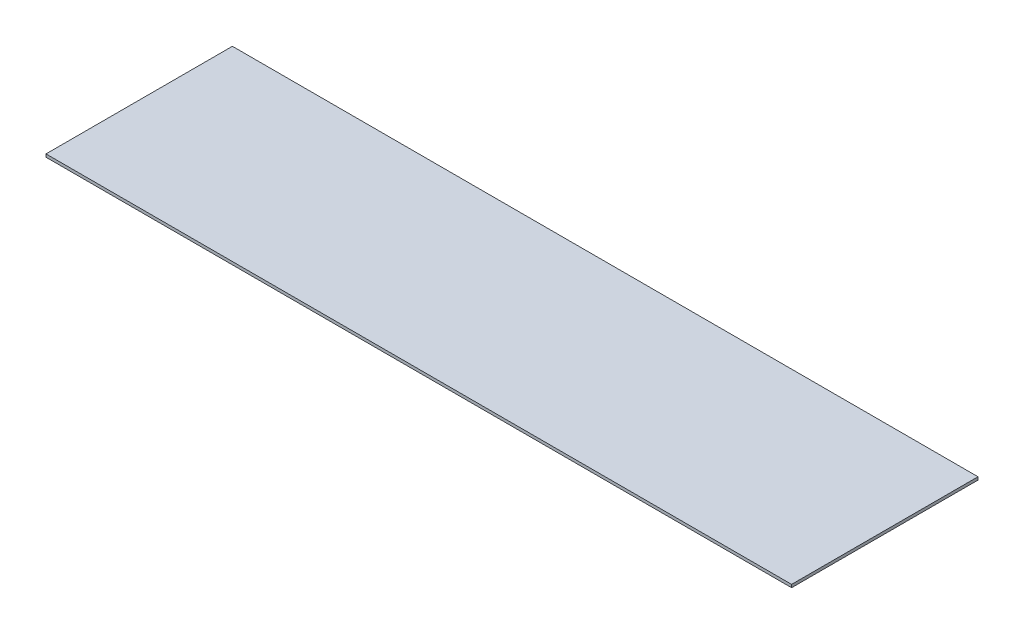
ISO-10303-21;
HEADER;
FILE_DESCRIPTION(('STEP AP214'),'2;1');
FILE_NAME('part.step','',(''),(''),'','','');
FILE_SCHEMA(('AUTOMOTIVE_DESIGN { 1 0 10303 214 1 1 1 1 }'));
ENDSEC;
DATA;
#1=APPLICATION_CONTEXT('core data for automotive mechanical design processes');
#2=APPLICATION_PROTOCOL_DEFINITION('international standard','automotive_design',2000,#1);
#3=PRODUCT_CONTEXT('',#1,'mechanical');
#4=PRODUCT('Part','Part','',(#3));
#5=PRODUCT_RELATED_PRODUCT_CATEGORY('part','',(#4));
#6=PRODUCT_DEFINITION_FORMATION('','',#4);
#7=PRODUCT_DEFINITION_CONTEXT('part definition',#1,'design');
#8=PRODUCT_DEFINITION('design','',#6,#7);
#9=PRODUCT_DEFINITION_SHAPE('','',#8);
#10=(LENGTH_UNIT() NAMED_UNIT(*) SI_UNIT(.MILLI.,.METRE.));
#11=(NAMED_UNIT(*) PLANE_ANGLE_UNIT() SI_UNIT($,.RADIAN.));
#12=(NAMED_UNIT(*) SI_UNIT($,.STERADIAN.) SOLID_ANGLE_UNIT());
#13=UNCERTAINTY_MEASURE_WITH_UNIT(LENGTH_MEASURE(1.E-05),#10,'distance_accuracy_value','');
#14=(GEOMETRIC_REPRESENTATION_CONTEXT(3) GLOBAL_UNCERTAINTY_ASSIGNED_CONTEXT((#13)) GLOBAL_UNIT_ASSIGNED_CONTEXT((#10,
#11,#12)) REPRESENTATION_CONTEXT('',''));
#15=CARTESIAN_POINT('',(0.,0.,0.));
#16=DIRECTION('',(0.,0.,1.));
#17=DIRECTION('',(1.,0.,0.));
#18=AXIS2_PLACEMENT_3D('',#15,#16,#17);
#19=CARTESIAN_POINT('',(0.,-1.5875,0.));
#20=DIRECTION('',(1.,0.,0.));
#21=DIRECTION('',(0.,0.,-1.));
#22=AXIS2_PLACEMENT_3D('',#19,#20,#21);
#23=PLANE('',#22);
#24=DIRECTION('',(0.,0.,-1.));
#25=VECTOR('',#24,1.);
#26=CARTESIAN_POINT('',(0.,0.,0.));
#27=LINE('',#26,#25);
#28=CARTESIAN_POINT('',(0.,0.,101.6));
#29=VERTEX_POINT('',#28);
#30=CARTESIAN_POINT('',(0.,0.,0.));
#31=VERTEX_POINT('',#30);
#32=EDGE_CURVE('E99',#29,#31,#27,.T.);
#33=ORIENTED_EDGE('',*,*,#32,.T.);
#34=DIRECTION('',(0.,1.,0.));
#35=VECTOR('',#34,1.);
#36=CARTESIAN_POINT('',(0.,-1.5875,0.));
#37=LINE('',#36,#35);
#38=CARTESIAN_POINT('',(0.,-1.5875,0.));
#39=VERTEX_POINT('',#38);
#40=EDGE_CURVE('E11',#39,#31,#37,.T.);
#41=ORIENTED_EDGE('',*,*,#40,.F.);
#42=DIRECTION('',(0.,0.,-1.));
#43=VECTOR('',#42,1.);
#44=CARTESIAN_POINT('',(0.,-1.5875,0.));
#45=LINE('',#44,#43);
#46=CARTESIAN_POINT('',(0.,-1.5875,101.6));
#47=VERTEX_POINT('',#46);
#48=EDGE_CURVE('E87',#47,#39,#45,.T.);
#49=ORIENTED_EDGE('',*,*,#48,.F.);
#50=DIRECTION('',(0.,1.,0.));
#51=VECTOR('',#50,1.);
#52=CARTESIAN_POINT('',(0.,-1.5875,101.6));
#53=LINE('',#52,#51);
#54=EDGE_CURVE('E95',#47,#29,#53,.T.);
#55=ORIENTED_EDGE('',*,*,#54,.T.);
#56=EDGE_LOOP('',(#33,#41,#49,#55));
#57=FACE_BOUND('',#56,.T.);
#58=ADVANCED_FACE('F36',(#57),#23,.F.);
#59=CARTESIAN_POINT('',(0.,-1.5875,0.));
#60=DIRECTION('',(0.,0.,1.));
#61=DIRECTION('',(1.,0.,0.));
#62=AXIS2_PLACEMENT_3D('',#59,#60,#61);
#63=PLANE('',#62);
#64=DIRECTION('',(1.,0.,0.));
#65=VECTOR('',#64,1.);
#66=CARTESIAN_POINT('',(0.,0.,0.));
#67=LINE('',#66,#65);
#68=CARTESIAN_POINT('',(406.4,0.,0.));
#69=VERTEX_POINT('',#68);
#70=EDGE_CURVE('E91',#31,#69,#67,.T.);
#71=ORIENTED_EDGE('',*,*,#70,.T.);
#72=DIRECTION('',(0.,1.,0.));
#73=VECTOR('',#72,1.);
#74=CARTESIAN_POINT('',(406.4,-1.5875,0.));
#75=LINE('',#74,#73);
#76=CARTESIAN_POINT('',(406.4,-1.5875,0.));
#77=VERTEX_POINT('',#76);
#78=EDGE_CURVE('E44',#77,#69,#75,.T.);
#79=ORIENTED_EDGE('',*,*,#78,.F.);
#80=DIRECTION('',(1.,0.,0.));
#81=VECTOR('',#80,1.);
#82=CARTESIAN_POINT('',(0.,-1.5875,0.));
#83=LINE('',#82,#81);
#84=EDGE_CURVE('E82',#39,#77,#83,.T.);
#85=ORIENTED_EDGE('',*,*,#84,.F.);
#86=ORIENTED_EDGE('',*,*,#40,.T.);
#87=EDGE_LOOP('',(#71,#79,#85,#86));
#88=FACE_BOUND('',#87,.T.);
#89=ADVANCED_FACE('F90',(#88),#63,.F.);
#90=CARTESIAN_POINT('',(406.4,-1.5875,0.));
#91=DIRECTION('',(-1.,0.,0.));
#92=DIRECTION('',(0.,0.,1.));
#93=AXIS2_PLACEMENT_3D('',#90,#91,#92);
#94=PLANE('',#93);
#95=DIRECTION('',(0.,0.,1.));
#96=VECTOR('',#95,1.);
#97=CARTESIAN_POINT('',(406.4,0.,0.));
#98=LINE('',#97,#96);
#99=CARTESIAN_POINT('',(406.4,0.,101.6));
#100=VERTEX_POINT('',#99);
#101=EDGE_CURVE('E69',#69,#100,#98,.T.);
#102=ORIENTED_EDGE('',*,*,#101,.T.);
#103=DIRECTION('',(0.,1.,0.));
#104=VECTOR('',#103,1.);
#105=CARTESIAN_POINT('',(406.4,-1.5875,101.6));
#106=LINE('',#105,#104);
#107=CARTESIAN_POINT('',(406.4,-1.5875,101.6));
#108=VERTEX_POINT('',#107);
#109=EDGE_CURVE('E92',#108,#100,#106,.T.);
#110=ORIENTED_EDGE('',*,*,#109,.F.);
#111=DIRECTION('',(0.,0.,1.));
#112=VECTOR('',#111,1.);
#113=CARTESIAN_POINT('',(406.4,-1.5875,0.));
#114=LINE('',#113,#112);
#115=EDGE_CURVE('E85',#77,#108,#114,.T.);
#116=ORIENTED_EDGE('',*,*,#115,.F.);
#117=ORIENTED_EDGE('',*,*,#78,.T.);
#118=EDGE_LOOP('',(#102,#110,#116,#117));
#119=FACE_BOUND('',#118,.T.);
#120=ADVANCED_FACE('F93',(#119),#94,.F.);
#121=CARTESIAN_POINT('',(0.,-1.5875,101.6));
#122=DIRECTION('',(0.,0.,-1.));
#123=DIRECTION('',(-1.,0.,0.));
#124=AXIS2_PLACEMENT_3D('',#121,#122,#123);
#125=PLANE('',#124);
#126=DIRECTION('',(-1.,0.,0.));
#127=VECTOR('',#126,1.);
#128=CARTESIAN_POINT('',(0.,0.,101.6));
#129=LINE('',#128,#127);
#130=EDGE_CURVE('E75',#100,#29,#129,.T.);
#131=ORIENTED_EDGE('',*,*,#130,.T.);
#132=ORIENTED_EDGE('',*,*,#54,.F.);
#133=DIRECTION('',(-1.,0.,0.));
#134=VECTOR('',#133,1.);
#135=CARTESIAN_POINT('',(0.,-1.5875,101.6));
#136=LINE('',#135,#134);
#137=EDGE_CURVE('E52',#108,#47,#136,.T.);
#138=ORIENTED_EDGE('',*,*,#137,.F.);
#139=ORIENTED_EDGE('',*,*,#109,.T.);
#140=EDGE_LOOP('',(#131,#132,#138,#139));
#141=FACE_BOUND('',#140,.T.);
#142=ADVANCED_FACE('F106',(#141),#125,.F.);
#143=CARTESIAN_POINT('',(0.,-1.5875,0.));
#144=DIRECTION('',(0.,1.,0.));
#145=DIRECTION('',(0.,0.,1.));
#146=AXIS2_PLACEMENT_3D('',#143,#144,#145);
#147=PLANE('',#146);
#148=ORIENTED_EDGE('',*,*,#48,.T.);
#149=ORIENTED_EDGE('',*,*,#84,.T.);
#150=ORIENTED_EDGE('',*,*,#115,.T.);
#151=ORIENTED_EDGE('',*,*,#137,.T.);
#152=EDGE_LOOP('',(#148,#149,#150,#151));
#153=FACE_BOUND('',#152,.T.);
#154=ADVANCED_FACE('F83',(#153),#147,.F.);
#155=CARTESIAN_POINT('',(0.,0.,0.));
#156=DIRECTION('',(0.,1.,0.));
#157=DIRECTION('',(0.,0.,1.));
#158=AXIS2_PLACEMENT_3D('',#155,#156,#157);
#159=PLANE('',#158);
#160=ORIENTED_EDGE('',*,*,#32,.F.);
#161=ORIENTED_EDGE('',*,*,#130,.F.);
#162=ORIENTED_EDGE('',*,*,#101,.F.);
#163=ORIENTED_EDGE('',*,*,#70,.F.);
#164=EDGE_LOOP('',(#160,#161,#162,#163));
#165=FACE_BOUND('',#164,.T.);
#166=ADVANCED_FACE('F109',(#165),#159,.T.);
#167=CLOSED_SHELL('',(#58,#89,#120,#142,#154,#166));
#168=MANIFOLD_SOLID_BREP('B2',#167);
#169=ADVANCED_BREP_SHAPE_REPRESENTATION('',(#18,#168),#14);
#170=SHAPE_DEFINITION_REPRESENTATION(#9,#169);
ENDSEC;
END-ISO-10303-21;
